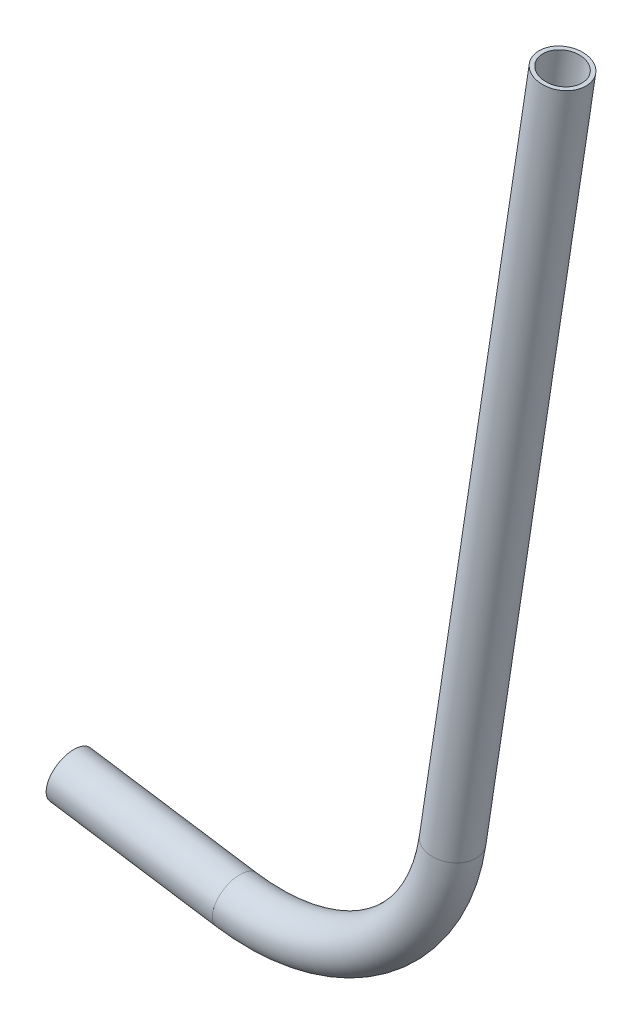
ISO-10303-21;
HEADER;
FILE_DESCRIPTION(('STEP AP214'),'2;1');
FILE_NAME('part.step','',(''),(''),'','','');
FILE_SCHEMA(('AUTOMOTIVE_DESIGN { 1 0 10303 214 1 1 1 1 }'));
ENDSEC;
DATA;
#1=APPLICATION_CONTEXT('core data for automotive mechanical design processes');
#2=APPLICATION_PROTOCOL_DEFINITION('international standard','automotive_design',2000,#1);
#3=PRODUCT_CONTEXT('',#1,'mechanical');
#4=PRODUCT('Part','Part','',(#3));
#5=PRODUCT_RELATED_PRODUCT_CATEGORY('part','',(#4));
#6=PRODUCT_DEFINITION_FORMATION('','',#4);
#7=PRODUCT_DEFINITION_CONTEXT('part definition',#1,'design');
#8=PRODUCT_DEFINITION('design','',#6,#7);
#9=PRODUCT_DEFINITION_SHAPE('','',#8);
#10=(LENGTH_UNIT() NAMED_UNIT(*) SI_UNIT(.MILLI.,.METRE.));
#11=(NAMED_UNIT(*) PLANE_ANGLE_UNIT() SI_UNIT($,.RADIAN.));
#12=(NAMED_UNIT(*) SI_UNIT($,.STERADIAN.) SOLID_ANGLE_UNIT());
#13=UNCERTAINTY_MEASURE_WITH_UNIT(LENGTH_MEASURE(1.E-05),#10,'distance_accuracy_value','');
#14=(GEOMETRIC_REPRESENTATION_CONTEXT(3) GLOBAL_UNCERTAINTY_ASSIGNED_CONTEXT((#13)) GLOBAL_UNIT_ASSIGNED_CONTEXT((#10,
#11,#12)) REPRESENTATION_CONTEXT('',''));
#15=CARTESIAN_POINT('',(0.,0.,0.));
#16=DIRECTION('',(0.,0.,1.));
#17=DIRECTION('',(1.,0.,0.));
#18=AXIS2_PLACEMENT_3D('',#15,#16,#17);
#19=CARTESIAN_POINT('',(74.0404436826143,123.962845863776,0.));
#20=DIRECTION('',(-0.988665090644708,0.150137731901384,0.));
#21=DIRECTION('',(-0.150137731901384,-0.988665090644708,0.));
#22=AXIS2_PLACEMENT_3D('',#19,#20,#21);
#23=CYLINDRICAL_SURFACE('',#22,5.28319999999999);
#24=CARTESIAN_POINT('',(29.5904436826143,130.712980207717,0.));
#25=DIRECTION('',(0.988665090644708,-0.150137731901384,0.));
#26=DIRECTION('',(0.150137731901384,0.988665090644708,0.));
#27=AXIS2_PLACEMENT_3D('',#24,#25,#26);
#28=CIRCLE('',#27,5.28319999999999);
#29=CARTESIAN_POINT('',(30.3836513477957,135.936295614611,0.));
#30=VERTEX_POINT('',#29);
#31=EDGE_CURVE('E55',#30,#30,#28,.T.);
#32=ORIENTED_EDGE('',*,*,#31,.F.);
#33=EDGE_LOOP('',(#32));
#34=FACE_BOUND('',#33,.T.);
#35=CARTESIAN_POINT('',(74.0404436826143,123.962845863776,0.));
#36=DIRECTION('',(0.988665090644708,-0.150137731901384,0.));
#37=DIRECTION('',(0.150137731901384,0.988665090644708,0.));
#38=AXIS2_PLACEMENT_3D('',#35,#36,#37);
#39=CIRCLE('',#38,5.28319999999999);
#40=CARTESIAN_POINT('',(74.8336513477957,129.18616127067,0.));
#41=VERTEX_POINT('',#40);
#42=EDGE_CURVE('E51',#41,#41,#39,.T.);
#43=ORIENTED_EDGE('',*,*,#42,.T.);
#44=EDGE_LOOP('',(#43));
#45=FACE_BOUND('',#44,.T.);
#46=ADVANCED_FACE('F47',(#34,#45),#23,.F.);
#47=CARTESIAN_POINT('',(74.0404436826143,123.962845863776,0.));
#48=DIRECTION('',(-0.988665090644708,0.150137731901384,0.));
#49=DIRECTION('',(-0.150137731901384,-0.988665090644708,0.));
#50=AXIS2_PLACEMENT_3D('',#47,#48,#49);
#51=CYLINDRICAL_SURFACE('',#50,6.35000000000001);
#52=CARTESIAN_POINT('',(29.5904436826143,130.712980207717,0.));
#53=DIRECTION('',(0.988665090644708,-0.150137731901384,0.));
#54=DIRECTION('',(0.150137731901384,0.988665090644708,0.));
#55=AXIS2_PLACEMENT_3D('',#52,#53,#54);
#56=CIRCLE('',#55,6.35000000000001);
#57=CARTESIAN_POINT('',(30.5438182801881,136.991003533311,0.));
#58=VERTEX_POINT('',#57);
#59=EDGE_CURVE('E59',#58,#58,#56,.T.);
#60=ORIENTED_EDGE('',*,*,#59,.T.);
#61=EDGE_LOOP('',(#60));
#62=FACE_BOUND('',#61,.T.);
#63=CARTESIAN_POINT('',(74.0404436826143,123.962845863776,0.));
#64=DIRECTION('',(0.988665090644708,-0.150137731901384,0.));
#65=DIRECTION('',(0.150137731901384,0.988665090644708,0.));
#66=AXIS2_PLACEMENT_3D('',#63,#64,#65);
#67=CIRCLE('',#66,6.35000000000001);
#68=CARTESIAN_POINT('',(74.9938182801881,130.24086918937,0.));
#69=VERTEX_POINT('',#68);
#70=EDGE_CURVE('E12',#69,#69,#67,.T.);
#71=ORIENTED_EDGE('',*,*,#70,.F.);
#72=EDGE_LOOP('',(#71));
#73=FACE_BOUND('',#72,.T.);
#74=ADVANCED_FACE('F74',(#62,#73),#51,.T.);
#75=CARTESIAN_POINT('',(29.5904436826143,130.712980207717,0.));
#76=DIRECTION('',(0.988665090644708,-0.150137731901384,0.));
#77=DIRECTION('',(0.150137731901384,0.988665090644708,0.));
#78=AXIS2_PLACEMENT_3D('',#75,#76,#77);
#79=PLANE('',#78);
#80=ORIENTED_EDGE('',*,*,#31,.T.);
#81=EDGE_LOOP('',(#80));
#82=FACE_BOUND('',#81,.T.);
#83=ORIENTED_EDGE('',*,*,#59,.F.);
#84=EDGE_LOOP('',(#83));
#85=FACE_BOUND('',#84,.T.);
#86=ADVANCED_FACE('F70',(#82,#85),#79,.F.);
#87=CARTESIAN_POINT('',(74.0404436826143,123.962845863776,0.));
#88=DIRECTION('',(0.988665090644708,-0.150137731901384,0.));
#89=DIRECTION('',(0.150137731901384,0.988665090644708,0.));
#90=AXIS2_PLACEMENT_3D('',#87,#88,#89);
#91=PLANE('',#90);
#92=ORIENTED_EDGE('',*,*,#42,.F.);
#93=EDGE_LOOP('',(#92));
#94=FACE_BOUND('',#93,.T.);
#95=ORIENTED_EDGE('',*,*,#70,.T.);
#96=EDGE_LOOP('',(#95));
#97=FACE_BOUND('',#96,.T.);
#98=ADVANCED_FACE('F49',(#94,#97),#91,.T.);
#99=CLOSED_SHELL('',(#46,#74,#86,#98));
#100=MANIFOLD_SOLID_BREP('B2',#99);
#101=CARTESIAN_POINT('',(81.6674404632046,174.187032468527,0.));
#102=DIRECTION('',(0.,0.,-1.));
#103=DIRECTION('',(-1.,0.,0.));
#104=AXIS2_PLACEMENT_3D('',#101,#102,#103);
#105=TOROIDAL_SURFACE('',#104,50.8,5.28319999999999);
#106=CARTESIAN_POINT('',(131.891627067956,166.560035687937,0.));
#107=DIRECTION('',(0.150137731901384,0.988665090644708,0.));
#108=DIRECTION('',(-0.988665090644708,0.150137731901384,0.));
#109=AXIS2_PLACEMENT_3D('',#106,#107,#108);
#110=CIRCLE('',#109,5.28319999999999);
#111=CARTESIAN_POINT('',(137.11494247485,165.766828022756,0.));
#112=VERTEX_POINT('',#111);
#113=EDGE_CURVE('E150',#112,#112,#110,.T.);
#114=CARTESIAN_POINT('',(74.0404436826143,123.962845863776,0.));
#115=DIRECTION('',(-0.988665090644708,0.150137731901384,0.));
#116=DIRECTION('',(-0.150137731901384,-0.988665090644708,0.));
#117=AXIS2_PLACEMENT_3D('',#114,#115,#116);
#118=CIRCLE('',#117,5.28319999999999);
#119=CARTESIAN_POINT('',(73.2472360174329,118.739530456882,0.));
#120=VERTEX_POINT('',#119);
#121=EDGE_CURVE('E140',#120,#120,#118,.T.);
#122=CARTESIAN_POINT('',(81.6674404632046,174.187032468527,0.));
#123=DIRECTION('',(0.,0.,-1.));
#124=DIRECTION('',(-1.,0.,0.));
#125=AXIS2_PLACEMENT_3D('',#122,#123,#124);
#126=CIRCLE('',#125,56.0832);
#127=EDGE_CURVE('',#112,#120,#126,.T.);
#128=ORIENTED_EDGE('',*,*,#113,.T.);
#129=ORIENTED_EDGE('',*,*,#121,.T.);
#130=ORIENTED_EDGE('',*,*,#127,.T.);
#131=ORIENTED_EDGE('',*,*,#127,.F.);
#132=EDGE_LOOP('',(#128,#130,#129,#131));
#133=FACE_BOUND('',#132,.T.);
#134=ADVANCED_FACE('F136',(#133),#105,.F.);
#135=CARTESIAN_POINT('',(81.6674404632046,174.187032468527,0.));
#136=DIRECTION('',(0.,0.,-1.));
#137=DIRECTION('',(-1.,0.,0.));
#138=AXIS2_PLACEMENT_3D('',#135,#136,#137);
#139=TOROIDAL_SURFACE('',#138,50.8,6.35000000000001);
#140=CARTESIAN_POINT('',(131.891627067956,166.560035687937,0.));
#141=DIRECTION('',(0.150137731901384,0.988665090644708,0.));
#142=DIRECTION('',(-0.988665090644708,0.150137731901384,0.));
#143=AXIS2_PLACEMENT_3D('',#140,#141,#142);
#144=CIRCLE('',#143,6.35000000000001);
#145=CARTESIAN_POINT('',(138.16965039355,165.606661090363,0.));
#146=VERTEX_POINT('',#145);
#147=EDGE_CURVE('E144',#146,#146,#144,.T.);
#148=CARTESIAN_POINT('',(74.0404436826143,123.962845863776,0.));
#149=DIRECTION('',(-0.988665090644708,0.150137731901384,0.));
#150=DIRECTION('',(-0.150137731901384,-0.988665090644708,0.));
#151=AXIS2_PLACEMENT_3D('',#148,#149,#150);
#152=CIRCLE('',#151,6.35000000000001);
#153=CARTESIAN_POINT('',(73.0870690850405,117.684822538182,0.));
#154=VERTEX_POINT('',#153);
#155=EDGE_CURVE('E46',#154,#154,#152,.T.);
#156=CARTESIAN_POINT('',(81.6674404632046,174.187032468527,0.));
#157=DIRECTION('',(0.,0.,-1.));
#158=DIRECTION('',(-1.,0.,0.));
#159=AXIS2_PLACEMENT_3D('',#156,#157,#158);
#160=CIRCLE('',#159,57.15);
#161=EDGE_CURVE('',#146,#154,#160,.T.);
#162=ORIENTED_EDGE('',*,*,#147,.F.);
#163=ORIENTED_EDGE('',*,*,#155,.F.);
#164=ORIENTED_EDGE('',*,*,#161,.T.);
#165=ORIENTED_EDGE('',*,*,#161,.F.);
#166=EDGE_LOOP('',(#162,#164,#163,#165));
#167=FACE_BOUND('',#166,.T.);
#168=ADVANCED_FACE('F163',(#167),#139,.T.);
#169=CARTESIAN_POINT('',(131.891627067956,166.560035687937,0.));
#170=DIRECTION('',(0.150137731901384,0.988665090644708,0.));
#171=DIRECTION('',(-0.988665090644708,0.150137731901384,0.));
#172=AXIS2_PLACEMENT_3D('',#169,#170,#171);
#173=PLANE('',#172);
#174=ORIENTED_EDGE('',*,*,#113,.F.);
#175=EDGE_LOOP('',(#174));
#176=FACE_BOUND('',#175,.T.);
#177=ORIENTED_EDGE('',*,*,#147,.T.);
#178=EDGE_LOOP('',(#177));
#179=FACE_BOUND('',#178,.T.);
#180=ADVANCED_FACE('F159',(#176,#179),#173,.T.);
#181=CARTESIAN_POINT('',(74.0404436826143,123.962845863776,0.));
#182=DIRECTION('',(-0.988665090644708,0.150137731901384,0.));
#183=DIRECTION('',(-0.150137731901384,-0.988665090644708,0.));
#184=AXIS2_PLACEMENT_3D('',#181,#182,#183);
#185=PLANE('',#184);
#186=ORIENTED_EDGE('',*,*,#121,.F.);
#187=EDGE_LOOP('',(#186));
#188=FACE_BOUND('',#187,.T.);
#189=ORIENTED_EDGE('',*,*,#155,.T.);
#190=EDGE_LOOP('',(#189));
#191=FACE_BOUND('',#190,.T.);
#192=ADVANCED_FACE('F138',(#188,#191),#185,.T.);
#193=CLOSED_SHELL('',(#134,#168,#180,#192));
#194=MANIFOLD_SOLID_BREP('B7',#193);
#195=CARTESIAN_POINT('',(161.2894079805,360.14601412635,0.));
#196=DIRECTION('',(-0.150137731901384,-0.988665090644708,0.));
#197=DIRECTION('',(0.988665090644708,-0.150137731901384,0.));
#198=AXIS2_PLACEMENT_3D('',#195,#196,#197);
#199=CYLINDRICAL_SURFACE('',#198,5.28319999999999);
#200=CARTESIAN_POINT('',(161.2894079805,360.14601412635,0.));
#201=DIRECTION('',(0.150137731901384,0.988665090644708,0.));
#202=DIRECTION('',(-0.988665090644708,0.150137731901384,0.));
#203=AXIS2_PLACEMENT_3D('',#200,#201,#202);
#204=CIRCLE('',#203,5.28319999999999);
#205=CARTESIAN_POINT('',(156.066092573606,360.939221791531,0.));
#206=VERTEX_POINT('',#205);
#207=EDGE_CURVE('E234',#206,#206,#204,.T.);
#208=ORIENTED_EDGE('',*,*,#207,.T.);
#209=EDGE_LOOP('',(#208));
#210=FACE_BOUND('',#209,.T.);
#211=CARTESIAN_POINT('',(131.891627067956,166.560035687937,0.));
#212=DIRECTION('',(-0.150137731901384,-0.988665090644708,0.));
#213=DIRECTION('',(0.988665090644708,-0.150137731901384,0.));
#214=AXIS2_PLACEMENT_3D('',#211,#212,#213);
#215=CIRCLE('',#214,5.28319999999999);
#216=CARTESIAN_POINT('',(137.11494247485,165.766828022756,0.));
#217=VERTEX_POINT('',#216);
#218=EDGE_CURVE('E224',#217,#217,#215,.T.);
#219=ORIENTED_EDGE('',*,*,#218,.T.);
#220=EDGE_LOOP('',(#219));
#221=FACE_BOUND('',#220,.T.);
#222=ADVANCED_FACE('F220',(#210,#221),#199,.F.);
#223=CARTESIAN_POINT('',(161.2894079805,360.14601412635,0.));
#224=DIRECTION('',(-0.150137731901384,-0.988665090644708,0.));
#225=DIRECTION('',(0.988665090644708,-0.150137731901384,0.));
#226=AXIS2_PLACEMENT_3D('',#223,#224,#225);
#227=CYLINDRICAL_SURFACE('',#226,6.35000000000001);
#228=CARTESIAN_POINT('',(161.2894079805,360.14601412635,0.));
#229=DIRECTION('',(0.150137731901384,0.988665090644708,0.));
#230=DIRECTION('',(-0.988665090644708,0.150137731901384,0.));
#231=AXIS2_PLACEMENT_3D('',#228,#229,#230);
#232=CIRCLE('',#231,6.35000000000001);
#233=CARTESIAN_POINT('',(155.011384654906,361.099388723923,0.));
#234=VERTEX_POINT('',#233);
#235=EDGE_CURVE('E228',#234,#234,#232,.T.);
#236=ORIENTED_EDGE('',*,*,#235,.F.);
#237=EDGE_LOOP('',(#236));
#238=FACE_BOUND('',#237,.T.);
#239=CARTESIAN_POINT('',(131.891627067956,166.560035687937,0.));
#240=DIRECTION('',(-0.150137731901384,-0.988665090644708,0.));
#241=DIRECTION('',(0.988665090644708,-0.150137731901384,0.));
#242=AXIS2_PLACEMENT_3D('',#239,#240,#241);
#243=CIRCLE('',#242,6.35000000000001);
#244=CARTESIAN_POINT('',(138.16965039355,165.606661090363,0.));
#245=VERTEX_POINT('',#244);
#246=EDGE_CURVE('E135',#245,#245,#243,.T.);
#247=ORIENTED_EDGE('',*,*,#246,.F.);
#248=EDGE_LOOP('',(#247));
#249=FACE_BOUND('',#248,.T.);
#250=ADVANCED_FACE('F247',(#238,#249),#227,.T.);
#251=CARTESIAN_POINT('',(161.2894079805,360.14601412635,0.));
#252=DIRECTION('',(0.150137731901384,0.988665090644708,0.));
#253=DIRECTION('',(-0.988665090644708,0.150137731901384,0.));
#254=AXIS2_PLACEMENT_3D('',#251,#252,#253);
#255=PLANE('',#254);
#256=ORIENTED_EDGE('',*,*,#207,.F.);
#257=EDGE_LOOP('',(#256));
#258=FACE_BOUND('',#257,.T.);
#259=ORIENTED_EDGE('',*,*,#235,.T.);
#260=EDGE_LOOP('',(#259));
#261=FACE_BOUND('',#260,.T.);
#262=ADVANCED_FACE('F243',(#258,#261),#255,.T.);
#263=CARTESIAN_POINT('',(131.891627067956,166.560035687937,0.));
#264=DIRECTION('',(-0.150137731901384,-0.988665090644708,0.));
#265=DIRECTION('',(0.988665090644708,-0.150137731901384,0.));
#266=AXIS2_PLACEMENT_3D('',#263,#264,#265);
#267=PLANE('',#266);
#268=ORIENTED_EDGE('',*,*,#218,.F.);
#269=EDGE_LOOP('',(#268));
#270=FACE_BOUND('',#269,.T.);
#271=ORIENTED_EDGE('',*,*,#246,.T.);
#272=EDGE_LOOP('',(#271));
#273=FACE_BOUND('',#272,.T.);
#274=ADVANCED_FACE('F222',(#270,#273),#267,.T.);
#275=CLOSED_SHELL('',(#222,#250,#262,#274));
#276=MANIFOLD_SOLID_BREP('B41',#275);
#277=ADVANCED_BREP_SHAPE_REPRESENTATION('',(#18,#100,#194,#276),#14);
#278=SHAPE_DEFINITION_REPRESENTATION(#9,#277);
ENDSEC;
END-ISO-10303-21;
